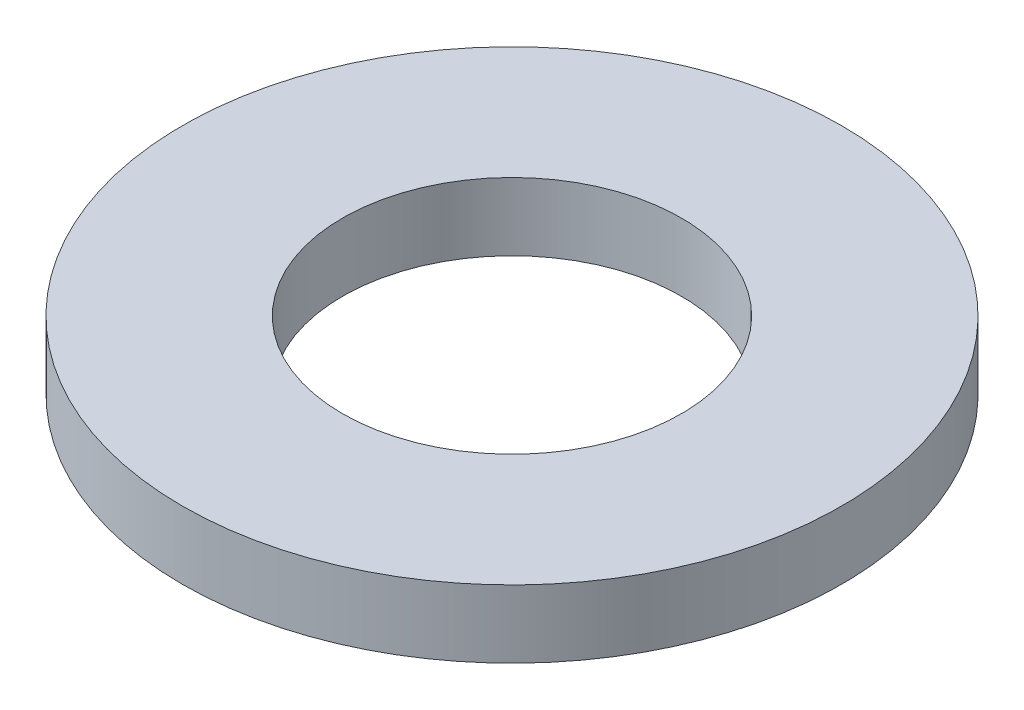
ISO-10303-21;
HEADER;
FILE_DESCRIPTION(('STEP AP214'),'2;1');
FILE_NAME('part.step','',(''),(''),'','','');
FILE_SCHEMA(('AUTOMOTIVE_DESIGN { 1 0 10303 214 1 1 1 1 }'));
ENDSEC;
DATA;
#1=APPLICATION_CONTEXT('core data for automotive mechanical design processes');
#2=APPLICATION_PROTOCOL_DEFINITION('international standard','automotive_design',2000,#1);
#3=PRODUCT_CONTEXT('',#1,'mechanical');
#4=PRODUCT('Part','Part','',(#3));
#5=PRODUCT_RELATED_PRODUCT_CATEGORY('part','',(#4));
#6=PRODUCT_DEFINITION_FORMATION('','',#4);
#7=PRODUCT_DEFINITION_CONTEXT('part definition',#1,'design');
#8=PRODUCT_DEFINITION('design','',#6,#7);
#9=PRODUCT_DEFINITION_SHAPE('','',#8);
#10=(LENGTH_UNIT() NAMED_UNIT(*) SI_UNIT(.MILLI.,.METRE.));
#11=(NAMED_UNIT(*) PLANE_ANGLE_UNIT() SI_UNIT($,.RADIAN.));
#12=(NAMED_UNIT(*) SI_UNIT($,.STERADIAN.) SOLID_ANGLE_UNIT());
#13=UNCERTAINTY_MEASURE_WITH_UNIT(LENGTH_MEASURE(1.E-05),#10,'distance_accuracy_value','');
#14=(GEOMETRIC_REPRESENTATION_CONTEXT(3) GLOBAL_UNCERTAINTY_ASSIGNED_CONTEXT((#13)) GLOBAL_UNIT_ASSIGNED_CONTEXT((#10,
#11,#12)) REPRESENTATION_CONTEXT('',''));
#15=CARTESIAN_POINT('',(0.,0.,0.));
#16=DIRECTION('',(0.,0.,1.));
#17=DIRECTION('',(1.,0.,0.));
#18=AXIS2_PLACEMENT_3D('',#15,#16,#17);
#19=CARTESIAN_POINT('',(0.,18.,0.));
#20=DIRECTION('',(0.,-1.,0.));
#21=DIRECTION('',(0.,0.,-1.));
#22=AXIS2_PLACEMENT_3D('',#19,#20,#21);
#23=CYLINDRICAL_SURFACE('',#22,87.5);
#24=CARTESIAN_POINT('',(0.,18.,0.));
#25=DIRECTION('',(0.,1.,0.));
#26=DIRECTION('',(0.,0.,1.));
#27=AXIS2_PLACEMENT_3D('',#24,#25,#26);
#28=CIRCLE('',#27,87.5);
#29=CARTESIAN_POINT('',(0.,18.,87.5));
#30=VERTEX_POINT('',#29);
#31=EDGE_CURVE('E10',#30,#30,#28,.T.);
#32=ORIENTED_EDGE('',*,*,#31,.F.);
#33=EDGE_LOOP('',(#32));
#34=FACE_BOUND('',#33,.T.);
#35=CARTESIAN_POINT('',(0.,0.,0.));
#36=DIRECTION('',(0.,1.,0.));
#37=DIRECTION('',(0.,0.,1.));
#38=AXIS2_PLACEMENT_3D('',#35,#36,#37);
#39=CIRCLE('',#38,87.5);
#40=CARTESIAN_POINT('',(0.,0.,87.5));
#41=VERTEX_POINT('',#40);
#42=EDGE_CURVE('E37',#41,#41,#39,.T.);
#43=ORIENTED_EDGE('',*,*,#42,.T.);
#44=EDGE_LOOP('',(#43));
#45=FACE_BOUND('',#44,.T.);
#46=ADVANCED_FACE('F40',(#34,#45),#23,.T.);
#47=CARTESIAN_POINT('',(0.,18.,0.));
#48=DIRECTION('',(0.,1.,0.));
#49=DIRECTION('',(0.,0.,1.));
#50=AXIS2_PLACEMENT_3D('',#47,#48,#49);
#51=PLANE('',#50);
#52=CARTESIAN_POINT('',(0.,18.,0.));
#53=DIRECTION('',(0.,1.,0.));
#54=DIRECTION('',(0.,0.,1.));
#55=AXIS2_PLACEMENT_3D('',#52,#53,#54);
#56=CIRCLE('',#55,45.);
#57=CARTESIAN_POINT('',(0.,18.,45.));
#58=VERTEX_POINT('',#57);
#59=EDGE_CURVE('E50',#58,#58,#56,.T.);
#60=ORIENTED_EDGE('',*,*,#59,.F.);
#61=EDGE_LOOP('',(#60));
#62=FACE_BOUND('',#61,.T.);
#63=ORIENTED_EDGE('',*,*,#31,.T.);
#64=EDGE_LOOP('',(#63));
#65=FACE_BOUND('',#64,.T.);
#66=ADVANCED_FACE('F59',(#62,#65),#51,.T.);
#67=CARTESIAN_POINT('',(0.,0.,0.));
#68=DIRECTION('',(0.,1.,0.));
#69=DIRECTION('',(0.,0.,1.));
#70=AXIS2_PLACEMENT_3D('',#67,#68,#69);
#71=PLANE('',#70);
#72=CARTESIAN_POINT('',(0.,0.,0.));
#73=DIRECTION('',(0.,1.,0.));
#74=DIRECTION('',(0.,0.,1.));
#75=AXIS2_PLACEMENT_3D('',#72,#73,#74);
#76=CIRCLE('',#75,45.);
#77=CARTESIAN_POINT('',(0.,0.,45.));
#78=VERTEX_POINT('',#77);
#79=EDGE_CURVE('E47',#78,#78,#76,.T.);
#80=ORIENTED_EDGE('',*,*,#79,.T.);
#81=EDGE_LOOP('',(#80));
#82=FACE_BOUND('',#81,.T.);
#83=ORIENTED_EDGE('',*,*,#42,.F.);
#84=EDGE_LOOP('',(#83));
#85=FACE_BOUND('',#84,.T.);
#86=ADVANCED_FACE('F58',(#82,#85),#71,.F.);
#87=CARTESIAN_POINT('',(0.,18.,0.));
#88=DIRECTION('',(0.,-1.,0.));
#89=DIRECTION('',(0.,0.,-1.));
#90=AXIS2_PLACEMENT_3D('',#87,#88,#89);
#91=CYLINDRICAL_SURFACE('',#90,45.);
#92=ORIENTED_EDGE('',*,*,#59,.T.);
#93=EDGE_LOOP('',(#92));
#94=FACE_BOUND('',#93,.T.);
#95=ORIENTED_EDGE('',*,*,#79,.F.);
#96=EDGE_LOOP('',(#95));
#97=FACE_BOUND('',#96,.T.);
#98=ADVANCED_FACE('F54',(#94,#97),#91,.F.);
#99=CLOSED_SHELL('',(#46,#66,#86,#98));
#100=MANIFOLD_SOLID_BREP('B2',#99);
#101=ADVANCED_BREP_SHAPE_REPRESENTATION('',(#18,#100),#14);
#102=SHAPE_DEFINITION_REPRESENTATION(#9,#101);
ENDSEC;
END-ISO-10303-21;
